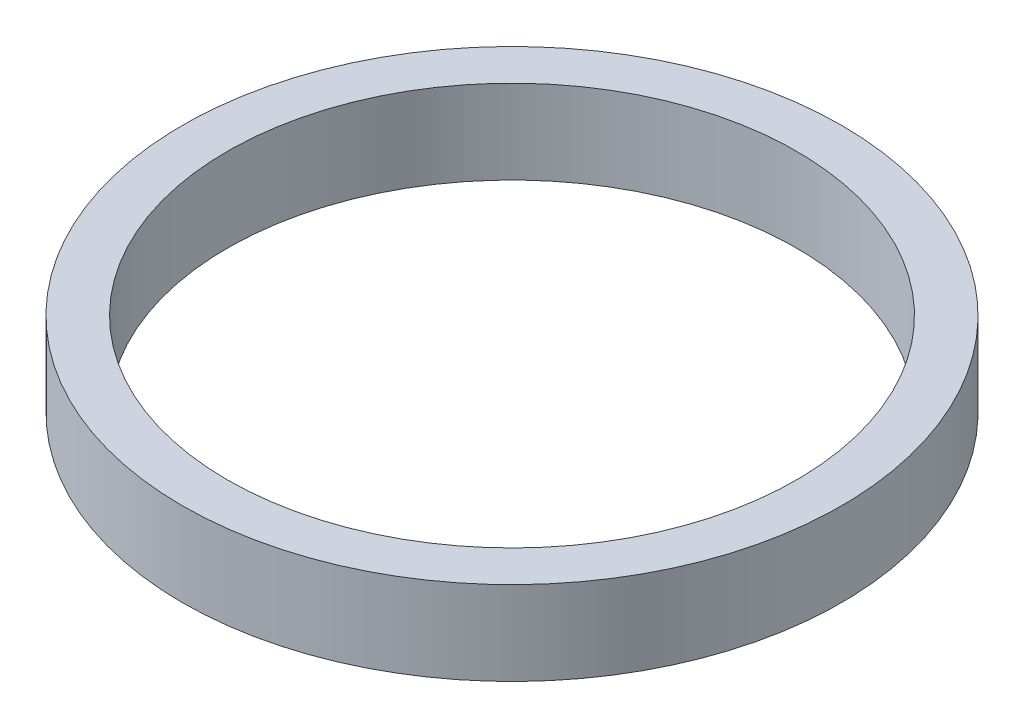
ISO-10303-21;
HEADER;
FILE_DESCRIPTION(('STEP AP214'),'2;1');
FILE_NAME('part.step','',(''),(''),'','','');
FILE_SCHEMA(('AUTOMOTIVE_DESIGN { 1 0 10303 214 1 1 1 1 }'));
ENDSEC;
DATA;
#1=APPLICATION_CONTEXT('core data for automotive mechanical design processes');
#2=APPLICATION_PROTOCOL_DEFINITION('international standard','automotive_design',2000,#1);
#3=PRODUCT_CONTEXT('',#1,'mechanical');
#4=PRODUCT('Part','Part','',(#3));
#5=PRODUCT_RELATED_PRODUCT_CATEGORY('part','',(#4));
#6=PRODUCT_DEFINITION_FORMATION('','',#4);
#7=PRODUCT_DEFINITION_CONTEXT('part definition',#1,'design');
#8=PRODUCT_DEFINITION('design','',#6,#7);
#9=PRODUCT_DEFINITION_SHAPE('','',#8);
#10=(LENGTH_UNIT() NAMED_UNIT(*) SI_UNIT(.MILLI.,.METRE.));
#11=(NAMED_UNIT(*) PLANE_ANGLE_UNIT() SI_UNIT($,.RADIAN.));
#12=(NAMED_UNIT(*) SI_UNIT($,.STERADIAN.) SOLID_ANGLE_UNIT());
#13=UNCERTAINTY_MEASURE_WITH_UNIT(LENGTH_MEASURE(1.E-05),#10,'distance_accuracy_value','');
#14=(GEOMETRIC_REPRESENTATION_CONTEXT(3) GLOBAL_UNCERTAINTY_ASSIGNED_CONTEXT((#13)) GLOBAL_UNIT_ASSIGNED_CONTEXT((#10,
#11,#12)) REPRESENTATION_CONTEXT('',''));
#15=CARTESIAN_POINT('',(0.,0.,0.));
#16=DIRECTION('',(0.,0.,1.));
#17=DIRECTION('',(1.,0.,0.));
#18=AXIS2_PLACEMENT_3D('',#15,#16,#17);
#19=CARTESIAN_POINT('',(0.,14.,0.));
#20=DIRECTION('',(0.,-1.,0.));
#21=DIRECTION('',(0.,0.,-1.));
#22=AXIS2_PLACEMENT_3D('',#19,#20,#21);
#23=CYLINDRICAL_SURFACE('',#22,55.);
#24=CARTESIAN_POINT('',(0.,14.,0.));
#25=DIRECTION('',(0.,1.,0.));
#26=DIRECTION('',(0.,0.,1.));
#27=AXIS2_PLACEMENT_3D('',#24,#25,#26);
#28=CIRCLE('',#27,55.);
#29=CARTESIAN_POINT('',(0.,14.,55.));
#30=VERTEX_POINT('',#29);
#31=EDGE_CURVE('E10',#30,#30,#28,.T.);
#32=ORIENTED_EDGE('',*,*,#31,.F.);
#33=EDGE_LOOP('',(#32));
#34=FACE_BOUND('',#33,.T.);
#35=CARTESIAN_POINT('',(0.,0.,0.));
#36=DIRECTION('',(0.,1.,0.));
#37=DIRECTION('',(0.,0.,1.));
#38=AXIS2_PLACEMENT_3D('',#35,#36,#37);
#39=CIRCLE('',#38,55.);
#40=CARTESIAN_POINT('',(0.,0.,55.));
#41=VERTEX_POINT('',#40);
#42=EDGE_CURVE('E37',#41,#41,#39,.T.);
#43=ORIENTED_EDGE('',*,*,#42,.T.);
#44=EDGE_LOOP('',(#43));
#45=FACE_BOUND('',#44,.T.);
#46=ADVANCED_FACE('F40',(#34,#45),#23,.T.);
#47=CARTESIAN_POINT('',(0.,14.,0.));
#48=DIRECTION('',(0.,1.,0.));
#49=DIRECTION('',(0.,0.,1.));
#50=AXIS2_PLACEMENT_3D('',#47,#48,#49);
#51=PLANE('',#50);
#52=CARTESIAN_POINT('',(0.,14.,0.));
#53=DIRECTION('',(0.,1.,0.));
#54=DIRECTION('',(0.,0.,1.));
#55=AXIS2_PLACEMENT_3D('',#52,#53,#54);
#56=CIRCLE('',#55,47.5);
#57=CARTESIAN_POINT('',(0.,14.,47.5));
#58=VERTEX_POINT('',#57);
#59=EDGE_CURVE('E50',#58,#58,#56,.T.);
#60=ORIENTED_EDGE('',*,*,#59,.F.);
#61=EDGE_LOOP('',(#60));
#62=FACE_BOUND('',#61,.T.);
#63=ORIENTED_EDGE('',*,*,#31,.T.);
#64=EDGE_LOOP('',(#63));
#65=FACE_BOUND('',#64,.T.);
#66=ADVANCED_FACE('F59',(#62,#65),#51,.T.);
#67=CARTESIAN_POINT('',(0.,0.,0.));
#68=DIRECTION('',(0.,1.,0.));
#69=DIRECTION('',(0.,0.,1.));
#70=AXIS2_PLACEMENT_3D('',#67,#68,#69);
#71=PLANE('',#70);
#72=CARTESIAN_POINT('',(0.,0.,0.));
#73=DIRECTION('',(0.,1.,0.));
#74=DIRECTION('',(0.,0.,1.));
#75=AXIS2_PLACEMENT_3D('',#72,#73,#74);
#76=CIRCLE('',#75,47.5);
#77=CARTESIAN_POINT('',(0.,0.,47.5));
#78=VERTEX_POINT('',#77);
#79=EDGE_CURVE('E47',#78,#78,#76,.T.);
#80=ORIENTED_EDGE('',*,*,#79,.T.);
#81=EDGE_LOOP('',(#80));
#82=FACE_BOUND('',#81,.T.);
#83=ORIENTED_EDGE('',*,*,#42,.F.);
#84=EDGE_LOOP('',(#83));
#85=FACE_BOUND('',#84,.T.);
#86=ADVANCED_FACE('F58',(#82,#85),#71,.F.);
#87=CARTESIAN_POINT('',(0.,14.,0.));
#88=DIRECTION('',(0.,-1.,0.));
#89=DIRECTION('',(0.,0.,-1.));
#90=AXIS2_PLACEMENT_3D('',#87,#88,#89);
#91=CYLINDRICAL_SURFACE('',#90,47.5);
#92=ORIENTED_EDGE('',*,*,#59,.T.);
#93=EDGE_LOOP('',(#92));
#94=FACE_BOUND('',#93,.T.);
#95=ORIENTED_EDGE('',*,*,#79,.F.);
#96=EDGE_LOOP('',(#95));
#97=FACE_BOUND('',#96,.T.);
#98=ADVANCED_FACE('F54',(#94,#97),#91,.F.);
#99=CLOSED_SHELL('',(#46,#66,#86,#98));
#100=MANIFOLD_SOLID_BREP('B2',#99);
#101=ADVANCED_BREP_SHAPE_REPRESENTATION('',(#18,#100),#14);
#102=SHAPE_DEFINITION_REPRESENTATION(#9,#101);
ENDSEC;
END-ISO-10303-21;
